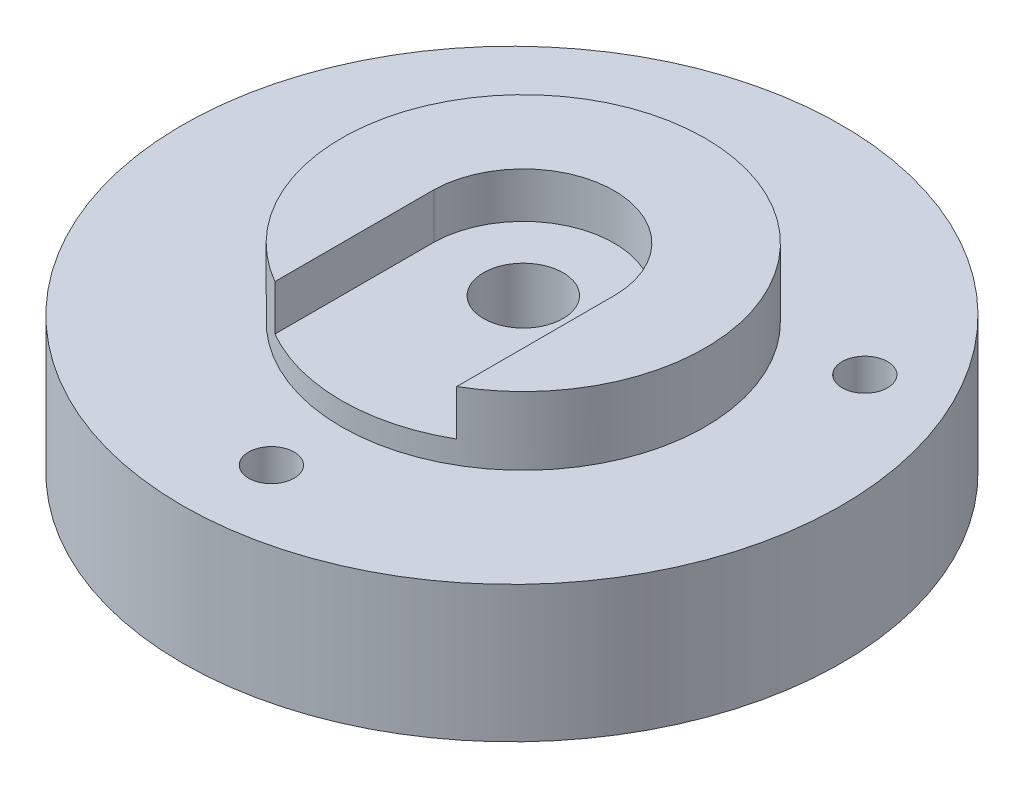
ISO-10303-21;
HEADER;
FILE_DESCRIPTION(('STEP AP214'),'2;1');
FILE_NAME('part.step','',(''),(''),'','','');
FILE_SCHEMA(('AUTOMOTIVE_DESIGN { 1 0 10303 214 1 1 1 1 }'));
ENDSEC;
DATA;
#1=APPLICATION_CONTEXT('core data for automotive mechanical design processes');
#2=APPLICATION_PROTOCOL_DEFINITION('international standard','automotive_design',2000,#1);
#3=PRODUCT_CONTEXT('',#1,'mechanical');
#4=PRODUCT('Part','Part','',(#3));
#5=PRODUCT_RELATED_PRODUCT_CATEGORY('part','',(#4));
#6=PRODUCT_DEFINITION_FORMATION('','',#4);
#7=PRODUCT_DEFINITION_CONTEXT('part definition',#1,'design');
#8=PRODUCT_DEFINITION('design','',#6,#7);
#9=PRODUCT_DEFINITION_SHAPE('','',#8);
#10=(LENGTH_UNIT() NAMED_UNIT(*) SI_UNIT(.MILLI.,.METRE.));
#11=(NAMED_UNIT(*) PLANE_ANGLE_UNIT() SI_UNIT($,.RADIAN.));
#12=(NAMED_UNIT(*) SI_UNIT($,.STERADIAN.) SOLID_ANGLE_UNIT());
#13=UNCERTAINTY_MEASURE_WITH_UNIT(LENGTH_MEASURE(1.E-05),#10,'distance_accuracy_value','');
#14=(GEOMETRIC_REPRESENTATION_CONTEXT(3) GLOBAL_UNCERTAINTY_ASSIGNED_CONTEXT((#13)) GLOBAL_UNIT_ASSIGNED_CONTEXT((#10,
#11,#12)) REPRESENTATION_CONTEXT('',''));
#15=CARTESIAN_POINT('',(0.,0.,0.));
#16=DIRECTION('',(0.,0.,1.));
#17=DIRECTION('',(1.,0.,0.));
#18=AXIS2_PLACEMENT_3D('',#15,#16,#17);
#19=CARTESIAN_POINT('',(75.,35.,72.5016317700457));
#20=DIRECTION('',(0.,1.,0.));
#21=DIRECTION('',(0.,0.,1.));
#22=AXIS2_PLACEMENT_3D('',#19,#20,#21);
#23=CYLINDRICAL_SURFACE('',#22,8.74999999999999);
#24=CARTESIAN_POINT('',(75.,35.,72.5016317700457));
#25=DIRECTION('',(0.,1.,0.));
#26=DIRECTION('',(0.,0.,1.));
#27=AXIS2_PLACEMENT_3D('',#24,#25,#26);
#28=CIRCLE('',#27,8.74999999999998);
#29=CARTESIAN_POINT('',(75.,35.,81.2516317700457));
#30=VERTEX_POINT('',#29);
#31=EDGE_CURVE('E212',#30,#30,#28,.T.);
#32=ORIENTED_EDGE('',*,*,#31,.T.);
#33=EDGE_LOOP('',(#32));
#34=FACE_BOUND('',#33,.T.);
#35=CARTESIAN_POINT('',(75.,15.,72.5016317700457));
#36=DIRECTION('',(0.,-1.,0.));
#37=DIRECTION('',(0.,0.,-1.));
#38=AXIS2_PLACEMENT_3D('',#35,#36,#37);
#39=CIRCLE('',#38,8.74999999999999);
#40=CARTESIAN_POINT('',(75.,15.,63.7516317700458));
#41=VERTEX_POINT('',#40);
#42=EDGE_CURVE('E273',#41,#41,#39,.F.);
#43=ORIENTED_EDGE('',*,*,#42,.F.);
#44=EDGE_LOOP('',(#43));
#45=FACE_BOUND('',#44,.T.);
#46=ADVANCED_FACE('F99',(#34,#45),#23,.F.);
#47=CARTESIAN_POINT('',(0.,0.,145.));
#48=DIRECTION('',(0.,1.,0.));
#49=DIRECTION('',(0.,0.,1.));
#50=AXIS2_PLACEMENT_3D('',#47,#48,#49);
#51=PLANE('',#50);
#52=CARTESIAN_POINT('',(72.5,0.,72.5));
#53=DIRECTION('',(0.,1.,0.));
#54=DIRECTION('',(0.,0.,1.));
#55=AXIS2_PLACEMENT_3D('',#52,#53,#54);
#56=CIRCLE('',#55,72.5);
#57=CARTESIAN_POINT('',(72.5,0.,145.));
#58=VERTEX_POINT('',#57);
#59=EDGE_CURVE('E245',#58,#58,#56,.T.);
#60=ORIENTED_EDGE('',*,*,#59,.F.);
#61=EDGE_LOOP('',(#60));
#62=FACE_BOUND('',#61,.T.);
#63=CARTESIAN_POINT('',(74.5832255811308,0.,127.501631770046));
#64=DIRECTION('',(0.,1.,0.));
#65=DIRECTION('',(0.,0.,1.));
#66=AXIS2_PLACEMENT_3D('',#63,#64,#65);
#67=CIRCLE('',#66,5.00000000000001);
#68=CARTESIAN_POINT('',(69.5903428143688,0.,127.234945292378));
#69=VERTEX_POINT('',#68);
#70=CARTESIAN_POINT('',(79.5795764973637,0.,127.310640875345));
#71=VERTEX_POINT('',#70);
#72=EDGE_CURVE('E209',#69,#71,#67,.T.);
#73=ORIENTED_EDGE('',*,*,#72,.T.);
#74=CARTESIAN_POINT('',(75.,0.,72.5016317700457));
#75=DIRECTION('',(0.,-1.,0.));
#76=DIRECTION('',(0.,0.,-1.));
#77=AXIS2_PLACEMENT_3D('',#74,#75,#76);
#78=CIRCLE('',#77,55.);
#79=CARTESIAN_POINT('',(124.93198927272,0.,49.4409195679259));
#80=VERTEX_POINT('',#79);
#81=EDGE_CURVE('E187',#80,#71,#78,.T.);
#82=ORIENTED_EDGE('',*,*,#81,.F.);
#83=CARTESIAN_POINT('',(122.631397208144,0.,45.0016317700455));
#84=DIRECTION('',(0.,1.,0.));
#85=DIRECTION('',(0.,0.,1.));
#86=AXIS2_PLACEMENT_3D('',#83,#84,#85);
#87=CIRCLE('',#86,5.00000000000002);
#88=CARTESIAN_POINT('',(119.937157232757,0.,40.7896166994378));
#89=VERTEX_POINT('',#88);
#90=EDGE_CURVE('E193',#80,#89,#87,.T.);
#91=ORIENTED_EDGE('',*,*,#90,.T.);
#92=CARTESIAN_POINT('',(30.0628427672424,0.,40.7896166994384));
#93=VERTEX_POINT('',#92);
#94=EDGE_CURVE('E175',#93,#89,#78,.T.);
#95=ORIENTED_EDGE('',*,*,#94,.F.);
#96=CARTESIAN_POINT('',(27.3686027918556,0.,45.0016317700462));
#97=DIRECTION('',(0.,1.,0.));
#98=DIRECTION('',(0.,0.,1.));
#99=AXIS2_PLACEMENT_3D('',#96,#97,#98);
#100=CIRCLE('',#99,5.);
#101=CARTESIAN_POINT('',(25.0680107272799,0.,49.4409195679267));
#102=VERTEX_POINT('',#101);
#103=EDGE_CURVE('E201',#93,#102,#100,.T.);
#104=ORIENTED_EDGE('',*,*,#103,.T.);
#105=EDGE_CURVE('E185',#69,#102,#78,.T.);
#106=ORIENTED_EDGE('',*,*,#105,.F.);
#107=EDGE_LOOP('',(#73,#82,#91,#95,#104,#106));
#108=FACE_BOUND('',#107,.T.);
#109=ADVANCED_FACE('F101',(#62,#108),#51,.F.);
#110=CARTESIAN_POINT('',(0.,30.,145.));
#111=DIRECTION('',(0.,1.,0.));
#112=DIRECTION('',(0.,0.,1.));
#113=AXIS2_PLACEMENT_3D('',#110,#111,#112);
#114=PLANE('',#113);
#115=CARTESIAN_POINT('',(27.3686027918556,30.,45.0016317700462));
#116=DIRECTION('',(0.,1.,0.));
#117=DIRECTION('',(0.,0.,1.));
#118=AXIS2_PLACEMENT_3D('',#115,#116,#117);
#119=CIRCLE('',#118,5.);
#120=CARTESIAN_POINT('',(27.3686027918556,30.,50.0016317700462));
#121=VERTEX_POINT('',#120);
#122=EDGE_CURVE('E208',#121,#121,#119,.F.);
#123=ORIENTED_EDGE('',*,*,#122,.T.);
#124=EDGE_LOOP('',(#123));
#125=FACE_BOUND('',#124,.T.);
#126=CARTESIAN_POINT('',(72.5,30.,72.5));
#127=DIRECTION('',(0.,1.,0.));
#128=DIRECTION('',(0.,0.,1.));
#129=AXIS2_PLACEMENT_3D('',#126,#127,#128);
#130=CIRCLE('',#129,72.5);
#131=CARTESIAN_POINT('',(72.5,30.,145.));
#132=VERTEX_POINT('',#131);
#133=EDGE_CURVE('E250',#132,#132,#130,.F.);
#134=ORIENTED_EDGE('',*,*,#133,.F.);
#135=EDGE_LOOP('',(#134));
#136=FACE_BOUND('',#135,.T.);
#137=CARTESIAN_POINT('',(75.,30.,72.5016317700457));
#138=DIRECTION('',(0.,1.,0.));
#139=DIRECTION('',(0.,0.,1.));
#140=AXIS2_PLACEMENT_3D('',#137,#138,#139);
#141=CIRCLE('',#140,40.);
#142=CARTESIAN_POINT('',(75.,30.,112.501631770046));
#143=VERTEX_POINT('',#142);
#144=EDGE_CURVE('E242',#143,#143,#141,.T.);
#145=ORIENTED_EDGE('',*,*,#144,.F.);
#146=EDGE_LOOP('',(#145));
#147=FACE_BOUND('',#146,.T.);
#148=CARTESIAN_POINT('',(74.5832255811308,30.,127.501631770046));
#149=DIRECTION('',(0.,1.,0.));
#150=DIRECTION('',(0.,0.,1.));
#151=AXIS2_PLACEMENT_3D('',#148,#149,#150);
#152=CIRCLE('',#151,5.00000000000001);
#153=CARTESIAN_POINT('',(74.5832255811308,30.,132.501631770046));
#154=VERTEX_POINT('',#153);
#155=EDGE_CURVE('E211',#154,#154,#152,.F.);
#156=ORIENTED_EDGE('',*,*,#155,.T.);
#157=EDGE_LOOP('',(#156));
#158=FACE_BOUND('',#157,.T.);
#159=CARTESIAN_POINT('',(122.631397208144,30.,45.0016317700455));
#160=DIRECTION('',(0.,1.,0.));
#161=DIRECTION('',(0.,0.,1.));
#162=AXIS2_PLACEMENT_3D('',#159,#160,#161);
#163=CIRCLE('',#162,5.00000000000002);
#164=CARTESIAN_POINT('',(122.631397208144,30.,50.0016317700455));
#165=VERTEX_POINT('',#164);
#166=EDGE_CURVE('E197',#165,#165,#163,.F.);
#167=ORIENTED_EDGE('',*,*,#166,.T.);
#168=EDGE_LOOP('',(#167));
#169=FACE_BOUND('',#168,.T.);
#170=ADVANCED_FACE('F297',(#125,#136,#147,#158,#169),#114,.T.);
#171=CARTESIAN_POINT('',(0.,45.,145.));
#172=DIRECTION('',(0.,1.,0.));
#173=DIRECTION('',(0.,0.,1.));
#174=AXIS2_PLACEMENT_3D('',#171,#172,#173);
#175=PLANE('',#174);
#176=DIRECTION('',(0.,0.,-1.));
#177=VECTOR('',#176,1.);
#178=CARTESIAN_POINT('',(95.,45.,0.));
#179=LINE('',#178,#177);
#180=CARTESIAN_POINT('',(95.,45.,107.142647921423));
#181=VERTEX_POINT('',#180);
#182=CARTESIAN_POINT('',(95.,45.,72.1426479214233));
#183=VERTEX_POINT('',#182);
#184=EDGE_CURVE('E215',#181,#183,#179,.T.);
#185=ORIENTED_EDGE('',*,*,#184,.F.);
#186=CARTESIAN_POINT('',(75.,45.,72.5016317700457));
#187=DIRECTION('',(0.,1.,0.));
#188=DIRECTION('',(0.,0.,1.));
#189=AXIS2_PLACEMENT_3D('',#186,#187,#188);
#190=CIRCLE('',#189,40.);
#191=CARTESIAN_POINT('',(55.,45.,107.142647921423));
#192=VERTEX_POINT('',#191);
#193=EDGE_CURVE('E235',#181,#192,#190,.T.);
#194=ORIENTED_EDGE('',*,*,#193,.T.);
#195=DIRECTION('',(0.,0.,-1.));
#196=VECTOR('',#195,1.);
#197=CARTESIAN_POINT('',(55.,45.,0.));
#198=LINE('',#197,#196);
#199=CARTESIAN_POINT('',(55.,45.,72.1426479214233));
#200=VERTEX_POINT('',#199);
#201=EDGE_CURVE('E220',#192,#200,#198,.T.);
#202=ORIENTED_EDGE('',*,*,#201,.T.);
#203=CARTESIAN_POINT('',(75.,45.,72.5016317700457));
#204=DIRECTION('',(0.,1.,0.));
#205=DIRECTION('',(0.,0.,1.));
#206=AXIS2_PLACEMENT_3D('',#203,#204,#205);
#207=CIRCLE('',#206,20.0032214756417);
#208=EDGE_CURVE('E228',#183,#200,#207,.T.);
#209=ORIENTED_EDGE('',*,*,#208,.F.);
#210=EDGE_LOOP('',(#185,#194,#202,#209));
#211=FACE_BOUND('',#210,.T.);
#212=ADVANCED_FACE('F300',(#211),#175,.T.);
#213=CARTESIAN_POINT('',(72.5,145.,72.5));
#214=DIRECTION('',(0.,-1.,0.));
#215=DIRECTION('',(0.,0.,-1.));
#216=AXIS2_PLACEMENT_3D('',#213,#214,#215);
#217=CYLINDRICAL_SURFACE('',#216,72.5);
#218=ORIENTED_EDGE('',*,*,#59,.T.);
#219=EDGE_LOOP('',(#218));
#220=FACE_BOUND('',#219,.T.);
#221=ORIENTED_EDGE('',*,*,#133,.T.);
#222=EDGE_LOOP('',(#221));
#223=FACE_BOUND('',#222,.T.);
#224=ADVANCED_FACE('F344',(#220,#223),#217,.T.);
#225=CARTESIAN_POINT('',(75.,30.,72.5016317700457));
#226=DIRECTION('',(0.,1.,0.));
#227=DIRECTION('',(0.,0.,1.));
#228=AXIS2_PLACEMENT_3D('',#225,#226,#227);
#229=CYLINDRICAL_SURFACE('',#228,40.);
#230=DIRECTION('',(0.,1.,0.));
#231=VECTOR('',#230,1.);
#232=CARTESIAN_POINT('',(95.,35.,107.142647921423));
#233=LINE('',#232,#231);
#234=CARTESIAN_POINT('',(95.,35.,107.142647921423));
#235=VERTEX_POINT('',#234);
#236=EDGE_CURVE('E233',#235,#181,#233,.T.);
#237=ORIENTED_EDGE('',*,*,#236,.F.);
#238=CARTESIAN_POINT('',(75.,35.,72.5016317700457));
#239=DIRECTION('',(0.,1.,0.));
#240=DIRECTION('',(0.,0.,1.));
#241=AXIS2_PLACEMENT_3D('',#238,#239,#240);
#242=CIRCLE('',#241,40.);
#243=CARTESIAN_POINT('',(55.,35.,107.142647921423));
#244=VERTEX_POINT('',#243);
#245=EDGE_CURVE('E223',#244,#235,#242,.T.);
#246=ORIENTED_EDGE('',*,*,#245,.F.);
#247=DIRECTION('',(0.,1.,0.));
#248=VECTOR('',#247,1.);
#249=CARTESIAN_POINT('',(55.,35.,107.142647921423));
#250=LINE('',#249,#248);
#251=EDGE_CURVE('E236',#244,#192,#250,.T.);
#252=ORIENTED_EDGE('',*,*,#251,.T.);
#253=ORIENTED_EDGE('',*,*,#193,.F.);
#254=EDGE_LOOP('',(#237,#246,#252,#253));
#255=FACE_BOUND('',#254,.T.);
#256=ORIENTED_EDGE('',*,*,#144,.T.);
#257=EDGE_LOOP('',(#256));
#258=FACE_BOUND('',#257,.T.);
#259=ADVANCED_FACE('F340',(#255,#258),#229,.T.);
#260=CARTESIAN_POINT('',(95.,35.,0.));
#261=DIRECTION('',(1.,0.,0.));
#262=DIRECTION('',(0.,0.,-1.));
#263=AXIS2_PLACEMENT_3D('',#260,#261,#262);
#264=PLANE('',#263);
#265=ORIENTED_EDGE('',*,*,#184,.T.);
#266=DIRECTION('',(0.,1.,0.));
#267=VECTOR('',#266,1.);
#268=CARTESIAN_POINT('',(95.,35.,72.1426479214233));
#269=LINE('',#268,#267);
#270=CARTESIAN_POINT('',(95.,35.,72.1426479214233));
#271=VERTEX_POINT('',#270);
#272=EDGE_CURVE('E225',#271,#183,#269,.T.);
#273=ORIENTED_EDGE('',*,*,#272,.F.);
#274=DIRECTION('',(0.,0.,-1.));
#275=VECTOR('',#274,1.);
#276=CARTESIAN_POINT('',(95.,35.,0.));
#277=LINE('',#276,#275);
#278=EDGE_CURVE('E216',#235,#271,#277,.T.);
#279=ORIENTED_EDGE('',*,*,#278,.F.);
#280=ORIENTED_EDGE('',*,*,#236,.T.);
#281=EDGE_LOOP('',(#265,#273,#279,#280));
#282=FACE_BOUND('',#281,.T.);
#283=ADVANCED_FACE('F333',(#282),#264,.F.);
#284=CARTESIAN_POINT('',(55.,35.,0.));
#285=DIRECTION('',(1.,0.,0.));
#286=DIRECTION('',(0.,0.,-1.));
#287=AXIS2_PLACEMENT_3D('',#284,#285,#286);
#288=PLANE('',#287);
#289=ORIENTED_EDGE('',*,*,#201,.F.);
#290=ORIENTED_EDGE('',*,*,#251,.F.);
#291=DIRECTION('',(0.,0.,-1.));
#292=VECTOR('',#291,1.);
#293=CARTESIAN_POINT('',(55.,35.,0.));
#294=LINE('',#293,#292);
#295=CARTESIAN_POINT('',(55.,35.,72.1426479214233));
#296=VERTEX_POINT('',#295);
#297=EDGE_CURVE('E121',#244,#296,#294,.T.);
#298=ORIENTED_EDGE('',*,*,#297,.T.);
#299=DIRECTION('',(0.,1.,0.));
#300=VECTOR('',#299,1.);
#301=CARTESIAN_POINT('',(55.,35.,72.1426479214233));
#302=LINE('',#301,#300);
#303=EDGE_CURVE('E239',#296,#200,#302,.T.);
#304=ORIENTED_EDGE('',*,*,#303,.T.);
#305=EDGE_LOOP('',(#289,#290,#298,#304));
#306=FACE_BOUND('',#305,.T.);
#307=ADVANCED_FACE('F330',(#306),#288,.T.);
#308=CARTESIAN_POINT('',(75.,35.,72.5016317700457));
#309=DIRECTION('',(0.,1.,0.));
#310=DIRECTION('',(0.,0.,1.));
#311=AXIS2_PLACEMENT_3D('',#308,#309,#310);
#312=CYLINDRICAL_SURFACE('',#311,20.0032214756417);
#313=ORIENTED_EDGE('',*,*,#208,.T.);
#314=ORIENTED_EDGE('',*,*,#303,.F.);
#315=CARTESIAN_POINT('',(75.,35.,72.5016317700457));
#316=DIRECTION('',(0.,1.,0.));
#317=DIRECTION('',(0.,0.,1.));
#318=AXIS2_PLACEMENT_3D('',#315,#316,#317);
#319=CIRCLE('',#318,20.0032214756417);
#320=EDGE_CURVE('E219',#271,#296,#319,.T.);
#321=ORIENTED_EDGE('',*,*,#320,.F.);
#322=ORIENTED_EDGE('',*,*,#272,.T.);
#323=EDGE_LOOP('',(#313,#314,#321,#322));
#324=FACE_BOUND('',#323,.T.);
#325=ADVANCED_FACE('F328',(#324),#312,.F.);
#326=CARTESIAN_POINT('',(0.,35.,0.));
#327=DIRECTION('',(0.,1.,0.));
#328=DIRECTION('',(0.,0.,1.));
#329=AXIS2_PLACEMENT_3D('',#326,#327,#328);
#330=PLANE('',#329);
#331=ORIENTED_EDGE('',*,*,#31,.F.);
#332=EDGE_LOOP('',(#331));
#333=FACE_BOUND('',#332,.T.);
#334=ORIENTED_EDGE('',*,*,#278,.T.);
#335=ORIENTED_EDGE('',*,*,#320,.T.);
#336=ORIENTED_EDGE('',*,*,#297,.F.);
#337=ORIENTED_EDGE('',*,*,#245,.T.);
#338=EDGE_LOOP('',(#334,#335,#336,#337));
#339=FACE_BOUND('',#338,.T.);
#340=ADVANCED_FACE('F325',(#333,#339),#330,.T.);
#341=CARTESIAN_POINT('',(74.5832255811308,83.,127.501631770046));
#342=DIRECTION('',(0.,-1.,0.));
#343=DIRECTION('',(0.,0.,-1.));
#344=AXIS2_PLACEMENT_3D('',#341,#342,#343);
#345=CYLINDRICAL_SURFACE('',#344,5.00000000000001);
#346=DIRECTION('',(0.,-1.,0.));
#347=VECTOR('',#346,1.);
#348=CARTESIAN_POINT('',(79.5795764973637,7.5,127.310640875345));
#349=LINE('',#348,#347);
#350=CARTESIAN_POINT('',(79.5795764973637,15.,127.310640875345));
#351=VERTEX_POINT('',#350);
#352=EDGE_CURVE('E198',#71,#351,#349,.F.);
#353=ORIENTED_EDGE('',*,*,#352,.F.);
#354=ORIENTED_EDGE('',*,*,#72,.F.);
#355=DIRECTION('',(0.,-1.,0.));
#356=VECTOR('',#355,1.);
#357=CARTESIAN_POINT('',(69.5903428143688,7.5,127.234945292378));
#358=LINE('',#357,#356);
#359=CARTESIAN_POINT('',(69.5903428143688,15.,127.234945292378));
#360=VERTEX_POINT('',#359);
#361=EDGE_CURVE('E203',#360,#69,#358,.T.);
#362=ORIENTED_EDGE('',*,*,#361,.F.);
#363=CARTESIAN_POINT('',(74.5832255811308,15.,127.501631770046));
#364=DIRECTION('',(0.,-1.,0.));
#365=DIRECTION('',(0.,0.,-1.));
#366=AXIS2_PLACEMENT_3D('',#363,#364,#365);
#367=CIRCLE('',#366,5.00000000000001);
#368=EDGE_CURVE('E268',#360,#351,#367,.T.);
#369=ORIENTED_EDGE('',*,*,#368,.T.);
#370=EDGE_LOOP('',(#353,#354,#362,#369));
#371=FACE_BOUND('',#370,.T.);
#372=ORIENTED_EDGE('',*,*,#155,.F.);
#373=EDGE_LOOP('',(#372));
#374=FACE_BOUND('',#373,.T.);
#375=ADVANCED_FACE('F286',(#371,#374),#345,.F.);
#376=CARTESIAN_POINT('',(27.3686027918556,83.,45.0016317700462));
#377=DIRECTION('',(0.,-1.,0.));
#378=DIRECTION('',(0.,0.,-1.));
#379=AXIS2_PLACEMENT_3D('',#376,#377,#378);
#380=CYLINDRICAL_SURFACE('',#379,5.);
#381=DIRECTION('',(0.,-1.,0.));
#382=VECTOR('',#381,1.);
#383=CARTESIAN_POINT('',(25.0680107272799,7.5,49.4409195679267));
#384=LINE('',#383,#382);
#385=CARTESIAN_POINT('',(25.0680107272799,15.,49.4409195679267));
#386=VERTEX_POINT('',#385);
#387=EDGE_CURVE('E277',#102,#386,#384,.F.);
#388=ORIENTED_EDGE('',*,*,#387,.F.);
#389=ORIENTED_EDGE('',*,*,#103,.F.);
#390=DIRECTION('',(0.,-1.,0.));
#391=VECTOR('',#390,1.);
#392=CARTESIAN_POINT('',(30.0628427672425,7.5,40.7896166994384));
#393=LINE('',#392,#391);
#394=CARTESIAN_POINT('',(30.0628427672424,15.,40.7896166994384));
#395=VERTEX_POINT('',#394);
#396=EDGE_CURVE('E180',#395,#93,#393,.T.);
#397=ORIENTED_EDGE('',*,*,#396,.F.);
#398=CARTESIAN_POINT('',(27.3686027918556,15.,45.0016317700462));
#399=DIRECTION('',(0.,-1.,0.));
#400=DIRECTION('',(0.,0.,-1.));
#401=AXIS2_PLACEMENT_3D('',#398,#399,#400);
#402=CIRCLE('',#401,5.);
#403=EDGE_CURVE('E264',#395,#386,#402,.T.);
#404=ORIENTED_EDGE('',*,*,#403,.T.);
#405=EDGE_LOOP('',(#388,#389,#397,#404));
#406=FACE_BOUND('',#405,.T.);
#407=ORIENTED_EDGE('',*,*,#122,.F.);
#408=EDGE_LOOP('',(#407));
#409=FACE_BOUND('',#408,.T.);
#410=ADVANCED_FACE('F291',(#406,#409),#380,.F.);
#411=CARTESIAN_POINT('',(122.631397208144,83.,45.0016317700455));
#412=DIRECTION('',(0.,-1.,0.));
#413=DIRECTION('',(0.,0.,-1.));
#414=AXIS2_PLACEMENT_3D('',#411,#412,#413);
#415=CYLINDRICAL_SURFACE('',#414,5.00000000000002);
#416=DIRECTION('',(0.,-1.,0.));
#417=VECTOR('',#416,1.);
#418=CARTESIAN_POINT('',(119.937157232757,7.5,40.7896166994377));
#419=LINE('',#418,#417);
#420=CARTESIAN_POINT('',(119.937157232757,15.,40.7896166994378));
#421=VERTEX_POINT('',#420);
#422=EDGE_CURVE('E12',#89,#421,#419,.F.);
#423=ORIENTED_EDGE('',*,*,#422,.F.);
#424=ORIENTED_EDGE('',*,*,#90,.F.);
#425=DIRECTION('',(0.,-1.,0.));
#426=VECTOR('',#425,1.);
#427=CARTESIAN_POINT('',(124.93198927272,7.5,49.440919567926));
#428=LINE('',#427,#426);
#429=CARTESIAN_POINT('',(124.93198927272,15.,49.4409195679259));
#430=VERTEX_POINT('',#429);
#431=EDGE_CURVE('E107',#430,#80,#428,.T.);
#432=ORIENTED_EDGE('',*,*,#431,.F.);
#433=CARTESIAN_POINT('',(122.631397208144,15.,45.0016317700455));
#434=DIRECTION('',(0.,-1.,0.));
#435=DIRECTION('',(0.,0.,-1.));
#436=AXIS2_PLACEMENT_3D('',#433,#434,#435);
#437=CIRCLE('',#436,5.00000000000002);
#438=EDGE_CURVE('E194',#430,#421,#437,.T.);
#439=ORIENTED_EDGE('',*,*,#438,.T.);
#440=EDGE_LOOP('',(#423,#424,#432,#439));
#441=FACE_BOUND('',#440,.T.);
#442=ORIENTED_EDGE('',*,*,#166,.F.);
#443=EDGE_LOOP('',(#442));
#444=FACE_BOUND('',#443,.T.);
#445=ADVANCED_FACE('F190',(#441,#444),#415,.F.);
#446=CARTESIAN_POINT('',(75.,15.,72.5016317700457));
#447=DIRECTION('',(0.,-1.,0.));
#448=DIRECTION('',(0.,0.,-1.));
#449=AXIS2_PLACEMENT_3D('',#446,#447,#448);
#450=CYLINDRICAL_SURFACE('',#449,55.);
#451=ORIENTED_EDGE('',*,*,#352,.T.);
#452=CARTESIAN_POINT('',(75.,15.,72.5016317700457));
#453=DIRECTION('',(0.,-1.,0.));
#454=DIRECTION('',(0.,0.,-1.));
#455=AXIS2_PLACEMENT_3D('',#452,#453,#454);
#456=CIRCLE('',#455,55.);
#457=EDGE_CURVE('E262',#430,#351,#456,.T.);
#458=ORIENTED_EDGE('',*,*,#457,.F.);
#459=ORIENTED_EDGE('',*,*,#431,.T.);
#460=ORIENTED_EDGE('',*,*,#81,.T.);
#461=EDGE_LOOP('',(#451,#458,#459,#460));
#462=FACE_BOUND('',#461,.T.);
#463=ADVANCED_FACE('F259',(#462),#450,.F.);
#464=ORIENTED_EDGE('',*,*,#361,.T.);
#465=ORIENTED_EDGE('',*,*,#105,.T.);
#466=ORIENTED_EDGE('',*,*,#387,.T.);
#467=EDGE_CURVE('E265',#360,#386,#456,.T.);
#468=ORIENTED_EDGE('',*,*,#467,.F.);
#469=EDGE_LOOP('',(#464,#465,#466,#468));
#470=FACE_BOUND('',#469,.T.);
#471=ADVANCED_FACE('F282',(#470),#450,.F.);
#472=CARTESIAN_POINT('',(75.,15.,72.5016317700457));
#473=DIRECTION('',(0.,-1.,0.));
#474=DIRECTION('',(0.,0.,-1.));
#475=AXIS2_PLACEMENT_3D('',#472,#473,#474);
#476=PLANE('',#475);
#477=ORIENTED_EDGE('',*,*,#467,.T.);
#478=ORIENTED_EDGE('',*,*,#403,.F.);
#479=EDGE_CURVE('E114',#395,#421,#456,.T.);
#480=ORIENTED_EDGE('',*,*,#479,.T.);
#481=ORIENTED_EDGE('',*,*,#438,.F.);
#482=ORIENTED_EDGE('',*,*,#457,.T.);
#483=ORIENTED_EDGE('',*,*,#368,.F.);
#484=EDGE_LOOP('',(#477,#478,#480,#481,#482,#483));
#485=FACE_BOUND('',#484,.T.);
#486=ORIENTED_EDGE('',*,*,#42,.T.);
#487=EDGE_LOOP('',(#486));
#488=FACE_BOUND('',#487,.T.);
#489=ADVANCED_FACE('F288',(#485,#488),#476,.T.);
#490=ORIENTED_EDGE('',*,*,#396,.T.);
#491=ORIENTED_EDGE('',*,*,#94,.T.);
#492=ORIENTED_EDGE('',*,*,#422,.T.);
#493=ORIENTED_EDGE('',*,*,#479,.F.);
#494=EDGE_LOOP('',(#490,#491,#492,#493));
#495=FACE_BOUND('',#494,.T.);
#496=ADVANCED_FACE('F177',(#495),#450,.F.);
#497=CLOSED_SHELL('',(#46,#109,#170,#212,#224,#259,#283,#307,#325,#340,#375,#410,#445,#463,#471,
#489,#496));
#498=MANIFOLD_SOLID_BREP('B2',#497);
#499=ADVANCED_BREP_SHAPE_REPRESENTATION('',(#18,#498),#14);
#500=SHAPE_DEFINITION_REPRESENTATION(#9,#499);
ENDSEC;
END-ISO-10303-21;
